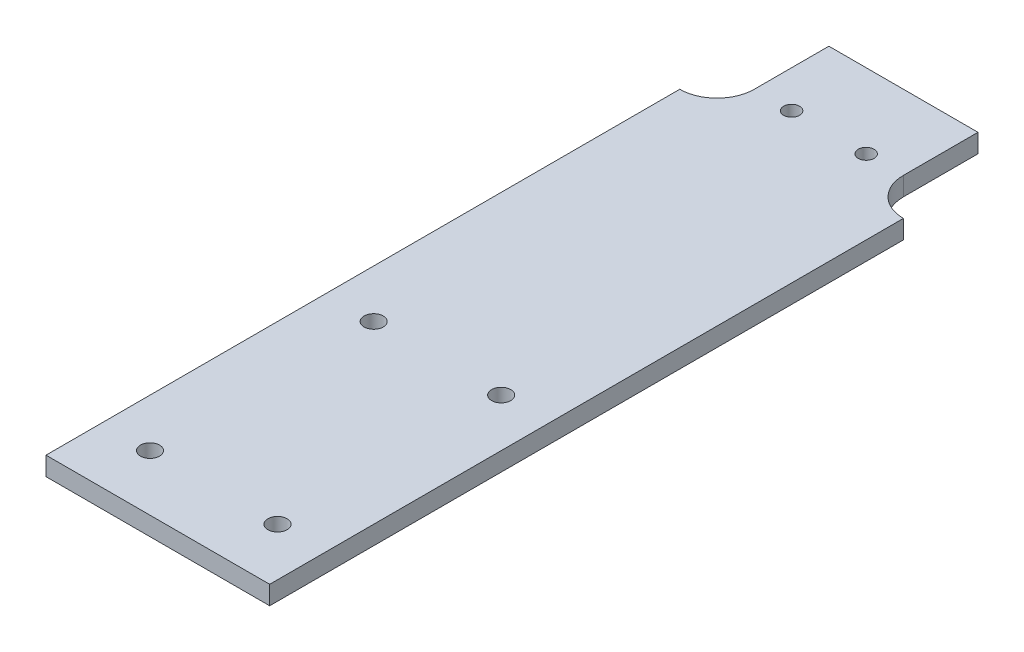
ISO-10303-21;
HEADER;
FILE_DESCRIPTION(('STEP AP214'),'2;1');
FILE_NAME('part.step','',(''),(''),'','','');
FILE_SCHEMA(('AUTOMOTIVE_DESIGN { 1 0 10303 214 1 1 1 1 }'));
ENDSEC;
DATA;
#1=APPLICATION_CONTEXT('core data for automotive mechanical design processes');
#2=APPLICATION_PROTOCOL_DEFINITION('international standard','automotive_design',2000,#1);
#3=PRODUCT_CONTEXT('',#1,'mechanical');
#4=PRODUCT('Part','Part','',(#3));
#5=PRODUCT_RELATED_PRODUCT_CATEGORY('part','',(#4));
#6=PRODUCT_DEFINITION_FORMATION('','',#4);
#7=PRODUCT_DEFINITION_CONTEXT('part definition',#1,'design');
#8=PRODUCT_DEFINITION('design','',#6,#7);
#9=PRODUCT_DEFINITION_SHAPE('','',#8);
#10=(LENGTH_UNIT() NAMED_UNIT(*) SI_UNIT(.MILLI.,.METRE.));
#11=(NAMED_UNIT(*) PLANE_ANGLE_UNIT() SI_UNIT($,.RADIAN.));
#12=(NAMED_UNIT(*) SI_UNIT($,.STERADIAN.) SOLID_ANGLE_UNIT());
#13=UNCERTAINTY_MEASURE_WITH_UNIT(LENGTH_MEASURE(1.E-05),#10,'distance_accuracy_value','');
#14=(GEOMETRIC_REPRESENTATION_CONTEXT(3) GLOBAL_UNCERTAINTY_ASSIGNED_CONTEXT((#13)) GLOBAL_UNIT_ASSIGNED_CONTEXT((#10,
#11,#12)) REPRESENTATION_CONTEXT('',''));
#15=CARTESIAN_POINT('',(0.,0.,0.));
#16=DIRECTION('',(0.,0.,1.));
#17=DIRECTION('',(1.,0.,0.));
#18=AXIS2_PLACEMENT_3D('',#15,#16,#17);
#19=CARTESIAN_POINT('',(-19.05,3.175,-50.8));
#20=DIRECTION('',(1.,0.,0.));
#21=DIRECTION('',(0.,0.,-1.));
#22=AXIS2_PLACEMENT_3D('',#19,#20,#21);
#23=PLANE('',#22);
#24=DIRECTION('',(0.,0.,1.));
#25=VECTOR('',#24,1.);
#26=CARTESIAN_POINT('',(-19.05,3.175,-50.8));
#27=LINE('',#26,#25);
#28=CARTESIAN_POINT('',(-19.05,3.175,-31.75));
#29=VERTEX_POINT('',#28);
#30=CARTESIAN_POINT('',(-19.05,3.175,76.2));
#31=VERTEX_POINT('',#30);
#32=EDGE_CURVE('E120',#29,#31,#27,.T.);
#33=ORIENTED_EDGE('',*,*,#32,.F.);
#34=DIRECTION('',(0.,-1.,0.));
#35=VECTOR('',#34,1.);
#36=CARTESIAN_POINT('',(-19.05,3.175,-31.75));
#37=LINE('',#36,#35);
#38=CARTESIAN_POINT('',(-19.05,0.,-31.75));
#39=VERTEX_POINT('',#38);
#40=EDGE_CURVE('E168',#29,#39,#37,.T.);
#41=ORIENTED_EDGE('',*,*,#40,.T.);
#42=DIRECTION('',(0.,0.,1.));
#43=VECTOR('',#42,1.);
#44=CARTESIAN_POINT('',(-19.05,0.,-50.8));
#45=LINE('',#44,#43);
#46=CARTESIAN_POINT('',(-19.05,0.,76.2));
#47=VERTEX_POINT('',#46);
#48=EDGE_CURVE('E196',#39,#47,#45,.T.);
#49=ORIENTED_EDGE('',*,*,#48,.T.);
#50=DIRECTION('',(0.,-1.,0.));
#51=VECTOR('',#50,1.);
#52=CARTESIAN_POINT('',(-19.05,3.175,76.2));
#53=LINE('',#52,#51);
#54=EDGE_CURVE('E137',#31,#47,#53,.T.);
#55=ORIENTED_EDGE('',*,*,#54,.F.);
#56=EDGE_LOOP('',(#33,#41,#49,#55));
#57=FACE_BOUND('',#56,.T.);
#58=ADVANCED_FACE('F34',(#57),#23,.F.);
#59=CARTESIAN_POINT('',(-19.05,3.175,76.2));
#60=DIRECTION('',(0.,0.,-1.));
#61=DIRECTION('',(-1.,0.,0.));
#62=AXIS2_PLACEMENT_3D('',#59,#60,#61);
#63=PLANE('',#62);
#64=DIRECTION('',(1.,0.,0.));
#65=VECTOR('',#64,1.);
#66=CARTESIAN_POINT('',(-19.05,0.,76.2));
#67=LINE('',#66,#65);
#68=CARTESIAN_POINT('',(19.05,0.,76.2));
#69=VERTEX_POINT('',#68);
#70=EDGE_CURVE('E126',#47,#69,#67,.T.);
#71=ORIENTED_EDGE('',*,*,#70,.T.);
#72=DIRECTION('',(0.,-1.,0.));
#73=VECTOR('',#72,1.);
#74=CARTESIAN_POINT('',(19.05,3.175,76.2));
#75=LINE('',#74,#73);
#76=CARTESIAN_POINT('',(19.05,3.175,76.2));
#77=VERTEX_POINT('',#76);
#78=EDGE_CURVE('E134',#77,#69,#75,.T.);
#79=ORIENTED_EDGE('',*,*,#78,.F.);
#80=DIRECTION('',(1.,0.,0.));
#81=VECTOR('',#80,1.);
#82=CARTESIAN_POINT('',(-19.05,3.175,76.2));
#83=LINE('',#82,#81);
#84=EDGE_CURVE('E123',#31,#77,#83,.T.);
#85=ORIENTED_EDGE('',*,*,#84,.F.);
#86=ORIENTED_EDGE('',*,*,#54,.T.);
#87=EDGE_LOOP('',(#71,#79,#85,#86));
#88=FACE_BOUND('',#87,.T.);
#89=ADVANCED_FACE('F198',(#88),#63,.F.);
#90=CARTESIAN_POINT('',(19.05,3.175,-50.8));
#91=DIRECTION('',(-1.,0.,0.));
#92=DIRECTION('',(0.,0.,1.));
#93=AXIS2_PLACEMENT_3D('',#90,#91,#92);
#94=PLANE('',#93);
#95=DIRECTION('',(0.,0.,-1.));
#96=VECTOR('',#95,1.);
#97=CARTESIAN_POINT('',(19.05,0.,-50.8));
#98=LINE('',#97,#96);
#99=CARTESIAN_POINT('',(19.05,0.,-31.75));
#100=VERTEX_POINT('',#99);
#101=EDGE_CURVE('E121',#69,#100,#98,.T.);
#102=ORIENTED_EDGE('',*,*,#101,.T.);
#103=DIRECTION('',(0.,-1.,0.));
#104=VECTOR('',#103,1.);
#105=CARTESIAN_POINT('',(19.05,3.175,-31.75));
#106=LINE('',#105,#104);
#107=CARTESIAN_POINT('',(19.05,3.175,-31.75));
#108=VERTEX_POINT('',#107);
#109=EDGE_CURVE('E115',#108,#100,#106,.T.);
#110=ORIENTED_EDGE('',*,*,#109,.F.);
#111=DIRECTION('',(0.,0.,-1.));
#112=VECTOR('',#111,1.);
#113=CARTESIAN_POINT('',(19.05,3.175,-50.8));
#114=LINE('',#113,#112);
#115=EDGE_CURVE('E131',#77,#108,#114,.T.);
#116=ORIENTED_EDGE('',*,*,#115,.F.);
#117=ORIENTED_EDGE('',*,*,#78,.T.);
#118=EDGE_LOOP('',(#102,#110,#116,#117));
#119=FACE_BOUND('',#118,.T.);
#120=ADVANCED_FACE('F156',(#119),#94,.F.);
#121=CARTESIAN_POINT('',(-19.05,3.175,-50.8));
#122=DIRECTION('',(0.,0.,1.));
#123=DIRECTION('',(1.,0.,0.));
#124=AXIS2_PLACEMENT_3D('',#121,#122,#123);
#125=PLANE('',#124);
#126=DIRECTION('',(-1.,0.,0.));
#127=VECTOR('',#126,1.);
#128=CARTESIAN_POINT('',(-19.05,3.175,-50.8));
#129=LINE('',#128,#127);
#130=CARTESIAN_POINT('',(12.7,3.175,-50.8));
#131=VERTEX_POINT('',#130);
#132=CARTESIAN_POINT('',(-12.7,3.175,-50.8));
#133=VERTEX_POINT('',#132);
#134=EDGE_CURVE('E113',#131,#133,#129,.T.);
#135=ORIENTED_EDGE('',*,*,#134,.F.);
#136=DIRECTION('',(0.,-1.,0.));
#137=VECTOR('',#136,1.);
#138=CARTESIAN_POINT('',(12.7,3.175,-50.8));
#139=LINE('',#138,#137);
#140=CARTESIAN_POINT('',(12.7,0.,-50.8));
#141=VERTEX_POINT('',#140);
#142=EDGE_CURVE('E100',#131,#141,#139,.T.);
#143=ORIENTED_EDGE('',*,*,#142,.T.);
#144=DIRECTION('',(-1.,0.,0.));
#145=VECTOR('',#144,1.);
#146=CARTESIAN_POINT('',(-19.05,0.,-50.8));
#147=LINE('',#146,#145);
#148=CARTESIAN_POINT('',(-12.7,0.,-50.8));
#149=VERTEX_POINT('',#148);
#150=EDGE_CURVE('E111',#141,#149,#147,.T.);
#151=ORIENTED_EDGE('',*,*,#150,.T.);
#152=DIRECTION('',(0.,-1.,0.));
#153=VECTOR('',#152,1.);
#154=CARTESIAN_POINT('',(-12.7,3.175,-50.8));
#155=LINE('',#154,#153);
#156=EDGE_CURVE('E167',#133,#149,#155,.T.);
#157=ORIENTED_EDGE('',*,*,#156,.F.);
#158=EDGE_LOOP('',(#135,#143,#151,#157));
#159=FACE_BOUND('',#158,.T.);
#160=ADVANCED_FACE('F109',(#159),#125,.F.);
#161=CARTESIAN_POINT('',(-19.05,3.175,-50.8));
#162=DIRECTION('',(0.,1.,0.));
#163=DIRECTION('',(0.,0.,1.));
#164=AXIS2_PLACEMENT_3D('',#161,#162,#163);
#165=PLANE('',#164);
#166=CARTESIAN_POINT('',(-6.35,3.175,-38.1));
#167=DIRECTION('',(0.,1.,0.));
#168=DIRECTION('',(0.,0.,1.));
#169=AXIS2_PLACEMENT_3D('',#166,#167,#168);
#170=CIRCLE('',#169,1.35254999999999);
#171=CARTESIAN_POINT('',(-6.35,3.175,-36.74745));
#172=VERTEX_POINT('',#171);
#173=EDGE_CURVE('E147',#172,#172,#170,.T.);
#174=ORIENTED_EDGE('',*,*,#173,.F.);
#175=EDGE_LOOP('',(#174));
#176=FACE_BOUND('',#175,.T.);
#177=CARTESIAN_POINT('',(6.35,3.175,-38.1));
#178=DIRECTION('',(0.,1.,0.));
#179=DIRECTION('',(0.,0.,1.));
#180=AXIS2_PLACEMENT_3D('',#177,#178,#179);
#181=CIRCLE('',#180,1.35254999999999);
#182=CARTESIAN_POINT('',(6.35,3.175,-36.74745));
#183=VERTEX_POINT('',#182);
#184=EDGE_CURVE('E143',#183,#183,#181,.T.);
#185=ORIENTED_EDGE('',*,*,#184,.F.);
#186=EDGE_LOOP('',(#185));
#187=FACE_BOUND('',#186,.T.);
#188=ORIENTED_EDGE('',*,*,#115,.T.);
#189=CARTESIAN_POINT('',(19.05,3.175,-38.1));
#190=DIRECTION('',(0.,1.,0.));
#191=DIRECTION('',(0.,0.,1.));
#192=AXIS2_PLACEMENT_3D('',#189,#190,#191);
#193=CIRCLE('',#192,6.35);
#194=CARTESIAN_POINT('',(12.7,3.175,-38.1));
#195=VERTEX_POINT('',#194);
#196=EDGE_CURVE('E11',#108,#195,#193,.F.);
#197=ORIENTED_EDGE('',*,*,#196,.T.);
#198=DIRECTION('',(0.,0.,-1.));
#199=VECTOR('',#198,1.);
#200=CARTESIAN_POINT('',(12.7,3.175,-50.8));
#201=LINE('',#200,#199);
#202=EDGE_CURVE('E105',#195,#131,#201,.T.);
#203=ORIENTED_EDGE('',*,*,#202,.T.);
#204=ORIENTED_EDGE('',*,*,#134,.T.);
#205=DIRECTION('',(0.,0.,1.));
#206=VECTOR('',#205,1.);
#207=CARTESIAN_POINT('',(-12.7,3.175,-50.8));
#208=LINE('',#207,#206);
#209=CARTESIAN_POINT('',(-12.7,3.175,-38.1));
#210=VERTEX_POINT('',#209);
#211=EDGE_CURVE('E164',#133,#210,#208,.T.);
#212=ORIENTED_EDGE('',*,*,#211,.T.);
#213=CARTESIAN_POINT('',(-19.05,3.175,-38.1));
#214=DIRECTION('',(0.,1.,0.));
#215=DIRECTION('',(0.,0.,1.));
#216=AXIS2_PLACEMENT_3D('',#213,#214,#215);
#217=CIRCLE('',#216,6.35);
#218=EDGE_CURVE('E152',#210,#29,#217,.F.);
#219=ORIENTED_EDGE('',*,*,#218,.T.);
#220=ORIENTED_EDGE('',*,*,#32,.T.);
#221=ORIENTED_EDGE('',*,*,#84,.T.);
#222=EDGE_LOOP('',(#188,#197,#203,#204,#212,#219,#220,#221));
#223=FACE_BOUND('',#222,.T.);
#224=CARTESIAN_POINT('',(-10.8585,3.175,28.575));
#225=DIRECTION('',(0.,1.,0.));
#226=DIRECTION('',(0.,0.,1.));
#227=AXIS2_PLACEMENT_3D('',#224,#225,#226);
#228=CIRCLE('',#227,1.63194999999998);
#229=CARTESIAN_POINT('',(-10.8585,3.175,30.20695));
#230=VERTEX_POINT('',#229);
#231=EDGE_CURVE('E175',#230,#230,#228,.T.);
#232=ORIENTED_EDGE('',*,*,#231,.F.);
#233=EDGE_LOOP('',(#232));
#234=FACE_BOUND('',#233,.T.);
#235=CARTESIAN_POINT('',(10.8585,3.175,28.575));
#236=DIRECTION('',(0.,1.,0.));
#237=DIRECTION('',(0.,0.,1.));
#238=AXIS2_PLACEMENT_3D('',#235,#236,#237);
#239=CIRCLE('',#238,1.63194999999998);
#240=CARTESIAN_POINT('',(10.8585,3.175,30.20695));
#241=VERTEX_POINT('',#240);
#242=EDGE_CURVE('E181',#241,#241,#239,.T.);
#243=ORIENTED_EDGE('',*,*,#242,.F.);
#244=EDGE_LOOP('',(#243));
#245=FACE_BOUND('',#244,.T.);
#246=CARTESIAN_POINT('',(-10.8585,3.175,66.675));
#247=DIRECTION('',(0.,1.,0.));
#248=DIRECTION('',(0.,0.,1.));
#249=AXIS2_PLACEMENT_3D('',#246,#247,#248);
#250=CIRCLE('',#249,1.63194999999998);
#251=CARTESIAN_POINT('',(-10.8585,3.175,68.30695));
#252=VERTEX_POINT('',#251);
#253=EDGE_CURVE('E187',#252,#252,#250,.T.);
#254=ORIENTED_EDGE('',*,*,#253,.F.);
#255=EDGE_LOOP('',(#254));
#256=FACE_BOUND('',#255,.T.);
#257=CARTESIAN_POINT('',(10.8585,3.175,66.675));
#258=DIRECTION('',(0.,1.,0.));
#259=DIRECTION('',(0.,0.,1.));
#260=AXIS2_PLACEMENT_3D('',#257,#258,#259);
#261=CIRCLE('',#260,1.63194999999998);
#262=CARTESIAN_POINT('',(10.8585,3.175,68.30695));
#263=VERTEX_POINT('',#262);
#264=EDGE_CURVE('E193',#263,#263,#261,.T.);
#265=ORIENTED_EDGE('',*,*,#264,.F.);
#266=EDGE_LOOP('',(#265));
#267=FACE_BOUND('',#266,.T.);
#268=ADVANCED_FACE('F212',(#176,#187,#223,#234,#245,#256,#267),#165,.T.);
#269=CARTESIAN_POINT('',(-19.05,0.,-50.8));
#270=DIRECTION('',(0.,1.,0.));
#271=DIRECTION('',(0.,0.,1.));
#272=AXIS2_PLACEMENT_3D('',#269,#270,#271);
#273=PLANE('',#272);
#274=CARTESIAN_POINT('',(-6.35,0.,-38.1));
#275=DIRECTION('',(0.,1.,0.));
#276=DIRECTION('',(0.,0.,1.));
#277=AXIS2_PLACEMENT_3D('',#274,#275,#276);
#278=CIRCLE('',#277,1.35254999999999);
#279=CARTESIAN_POINT('',(-6.35,0.,-36.74745));
#280=VERTEX_POINT('',#279);
#281=EDGE_CURVE('E144',#280,#280,#278,.T.);
#282=ORIENTED_EDGE('',*,*,#281,.T.);
#283=EDGE_LOOP('',(#282));
#284=FACE_BOUND('',#283,.T.);
#285=CARTESIAN_POINT('',(6.35,0.,-38.1));
#286=DIRECTION('',(0.,1.,0.));
#287=DIRECTION('',(0.,0.,1.));
#288=AXIS2_PLACEMENT_3D('',#285,#286,#287);
#289=CIRCLE('',#288,1.35254999999999);
#290=CARTESIAN_POINT('',(6.35,0.,-36.74745));
#291=VERTEX_POINT('',#290);
#292=EDGE_CURVE('E106',#291,#291,#289,.T.);
#293=ORIENTED_EDGE('',*,*,#292,.T.);
#294=EDGE_LOOP('',(#293));
#295=FACE_BOUND('',#294,.T.);
#296=CARTESIAN_POINT('',(-10.8585,0.,28.575));
#297=DIRECTION('',(0.,-1.,0.));
#298=DIRECTION('',(0.,0.,-1.));
#299=AXIS2_PLACEMENT_3D('',#296,#297,#298);
#300=CIRCLE('',#299,1.63194999999999);
#301=CARTESIAN_POINT('',(-10.8585,0.,26.94305));
#302=VERTEX_POINT('',#301);
#303=EDGE_CURVE('E171',#302,#302,#300,.T.);
#304=ORIENTED_EDGE('',*,*,#303,.F.);
#305=EDGE_LOOP('',(#304));
#306=FACE_BOUND('',#305,.T.);
#307=CARTESIAN_POINT('',(10.8585,0.,28.575));
#308=DIRECTION('',(0.,-1.,0.));
#309=DIRECTION('',(0.,0.,-1.));
#310=AXIS2_PLACEMENT_3D('',#307,#308,#309);
#311=CIRCLE('',#310,1.63194999999999);
#312=CARTESIAN_POINT('',(10.8585,0.,26.94305));
#313=VERTEX_POINT('',#312);
#314=EDGE_CURVE('E178',#313,#313,#311,.T.);
#315=ORIENTED_EDGE('',*,*,#314,.F.);
#316=EDGE_LOOP('',(#315));
#317=FACE_BOUND('',#316,.T.);
#318=CARTESIAN_POINT('',(-10.8585,0.,66.675));
#319=DIRECTION('',(0.,-1.,0.));
#320=DIRECTION('',(0.,0.,-1.));
#321=AXIS2_PLACEMENT_3D('',#318,#319,#320);
#322=CIRCLE('',#321,1.63194999999999);
#323=CARTESIAN_POINT('',(-10.8585,0.,65.04305));
#324=VERTEX_POINT('',#323);
#325=EDGE_CURVE('E184',#324,#324,#322,.T.);
#326=ORIENTED_EDGE('',*,*,#325,.F.);
#327=EDGE_LOOP('',(#326));
#328=FACE_BOUND('',#327,.T.);
#329=CARTESIAN_POINT('',(10.8585,0.,66.675));
#330=DIRECTION('',(0.,-1.,0.));
#331=DIRECTION('',(0.,0.,-1.));
#332=AXIS2_PLACEMENT_3D('',#329,#330,#331);
#333=CIRCLE('',#332,1.63194999999999);
#334=CARTESIAN_POINT('',(10.8585,0.,65.04305));
#335=VERTEX_POINT('',#334);
#336=EDGE_CURVE('E190',#335,#335,#333,.T.);
#337=ORIENTED_EDGE('',*,*,#336,.F.);
#338=EDGE_LOOP('',(#337));
#339=FACE_BOUND('',#338,.T.);
#340=ORIENTED_EDGE('',*,*,#150,.F.);
#341=DIRECTION('',(0.,0.,-1.));
#342=VECTOR('',#341,1.);
#343=CARTESIAN_POINT('',(12.7,0.,-50.8));
#344=LINE('',#343,#342);
#345=CARTESIAN_POINT('',(12.7,0.,-38.1));
#346=VERTEX_POINT('',#345);
#347=EDGE_CURVE('E97',#346,#141,#344,.T.);
#348=ORIENTED_EDGE('',*,*,#347,.F.);
#349=CARTESIAN_POINT('',(19.05,0.,-38.1));
#350=DIRECTION('',(0.,1.,0.));
#351=DIRECTION('',(0.,0.,1.));
#352=AXIS2_PLACEMENT_3D('',#349,#350,#351);
#353=CIRCLE('',#352,6.35);
#354=EDGE_CURVE('E41',#346,#100,#353,.T.);
#355=ORIENTED_EDGE('',*,*,#354,.T.);
#356=ORIENTED_EDGE('',*,*,#101,.F.);
#357=ORIENTED_EDGE('',*,*,#70,.F.);
#358=ORIENTED_EDGE('',*,*,#48,.F.);
#359=CARTESIAN_POINT('',(-19.05,0.,-38.1));
#360=DIRECTION('',(0.,1.,0.));
#361=DIRECTION('',(0.,0.,1.));
#362=AXIS2_PLACEMENT_3D('',#359,#360,#361);
#363=CIRCLE('',#362,6.35);
#364=CARTESIAN_POINT('',(-12.7,0.,-38.1));
#365=VERTEX_POINT('',#364);
#366=EDGE_CURVE('E150',#39,#365,#363,.T.);
#367=ORIENTED_EDGE('',*,*,#366,.T.);
#368=DIRECTION('',(0.,0.,1.));
#369=VECTOR('',#368,1.);
#370=CARTESIAN_POINT('',(-12.7,0.,-50.8));
#371=LINE('',#370,#369);
#372=EDGE_CURVE('E114',#149,#365,#371,.T.);
#373=ORIENTED_EDGE('',*,*,#372,.F.);
#374=EDGE_LOOP('',(#340,#348,#355,#356,#357,#358,#367,#373));
#375=FACE_BOUND('',#374,.T.);
#376=ADVANCED_FACE('F118',(#284,#295,#306,#317,#328,#339,#375),#273,.F.);
#377=CARTESIAN_POINT('',(10.8585,0.,66.675));
#378=DIRECTION('',(0.,-1.,0.));
#379=DIRECTION('',(0.,0.,-1.));
#380=AXIS2_PLACEMENT_3D('',#377,#378,#379);
#381=CYLINDRICAL_SURFACE('',#380,1.63194999999998);
#382=ORIENTED_EDGE('',*,*,#264,.T.);
#383=EDGE_LOOP('',(#382));
#384=FACE_BOUND('',#383,.T.);
#385=ORIENTED_EDGE('',*,*,#336,.T.);
#386=EDGE_LOOP('',(#385));
#387=FACE_BOUND('',#386,.T.);
#388=ADVANCED_FACE('F225',(#384,#387),#381,.F.);
#389=CARTESIAN_POINT('',(-10.8585,0.,66.675));
#390=DIRECTION('',(0.,-1.,0.));
#391=DIRECTION('',(0.,0.,-1.));
#392=AXIS2_PLACEMENT_3D('',#389,#390,#391);
#393=CYLINDRICAL_SURFACE('',#392,1.63194999999998);
#394=ORIENTED_EDGE('',*,*,#253,.T.);
#395=EDGE_LOOP('',(#394));
#396=FACE_BOUND('',#395,.T.);
#397=ORIENTED_EDGE('',*,*,#325,.T.);
#398=EDGE_LOOP('',(#397));
#399=FACE_BOUND('',#398,.T.);
#400=ADVANCED_FACE('F228',(#396,#399),#393,.F.);
#401=CARTESIAN_POINT('',(10.8585,0.,28.575));
#402=DIRECTION('',(0.,-1.,0.));
#403=DIRECTION('',(0.,0.,-1.));
#404=AXIS2_PLACEMENT_3D('',#401,#402,#403);
#405=CYLINDRICAL_SURFACE('',#404,1.63194999999998);
#406=ORIENTED_EDGE('',*,*,#242,.T.);
#407=EDGE_LOOP('',(#406));
#408=FACE_BOUND('',#407,.T.);
#409=ORIENTED_EDGE('',*,*,#314,.T.);
#410=EDGE_LOOP('',(#409));
#411=FACE_BOUND('',#410,.T.);
#412=ADVANCED_FACE('F316',(#408,#411),#405,.F.);
#413=CARTESIAN_POINT('',(-10.8585,0.,28.575));
#414=DIRECTION('',(0.,-1.,0.));
#415=DIRECTION('',(0.,0.,-1.));
#416=AXIS2_PLACEMENT_3D('',#413,#414,#415);
#417=CYLINDRICAL_SURFACE('',#416,1.63194999999998);
#418=ORIENTED_EDGE('',*,*,#231,.T.);
#419=EDGE_LOOP('',(#418));
#420=FACE_BOUND('',#419,.T.);
#421=ORIENTED_EDGE('',*,*,#303,.T.);
#422=EDGE_LOOP('',(#421));
#423=FACE_BOUND('',#422,.T.);
#424=ADVANCED_FACE('F274',(#420,#423),#417,.F.);
#425=CARTESIAN_POINT('',(-12.7,3.175,-50.8));
#426=DIRECTION('',(1.,0.,0.));
#427=DIRECTION('',(0.,0.,-1.));
#428=AXIS2_PLACEMENT_3D('',#425,#426,#427);
#429=PLANE('',#428);
#430=ORIENTED_EDGE('',*,*,#372,.T.);
#431=DIRECTION('',(0.,-1.,0.));
#432=VECTOR('',#431,1.);
#433=CARTESIAN_POINT('',(-12.7,3.175,-38.1));
#434=LINE('',#433,#432);
#435=EDGE_CURVE('E140',#365,#210,#434,.F.);
#436=ORIENTED_EDGE('',*,*,#435,.T.);
#437=ORIENTED_EDGE('',*,*,#211,.F.);
#438=ORIENTED_EDGE('',*,*,#156,.T.);
#439=EDGE_LOOP('',(#430,#436,#437,#438));
#440=FACE_BOUND('',#439,.T.);
#441=ADVANCED_FACE('F211',(#440),#429,.F.);
#442=CARTESIAN_POINT('',(12.7,3.175,-50.8));
#443=DIRECTION('',(-1.,0.,0.));
#444=DIRECTION('',(0.,0.,1.));
#445=AXIS2_PLACEMENT_3D('',#442,#443,#444);
#446=PLANE('',#445);
#447=ORIENTED_EDGE('',*,*,#202,.F.);
#448=DIRECTION('',(0.,-1.,0.));
#449=VECTOR('',#448,1.);
#450=CARTESIAN_POINT('',(12.7,0.,-38.1));
#451=LINE('',#450,#449);
#452=EDGE_CURVE('E102',#195,#346,#451,.T.);
#453=ORIENTED_EDGE('',*,*,#452,.T.);
#454=ORIENTED_EDGE('',*,*,#347,.T.);
#455=ORIENTED_EDGE('',*,*,#142,.F.);
#456=EDGE_LOOP('',(#447,#453,#454,#455));
#457=FACE_BOUND('',#456,.T.);
#458=ADVANCED_FACE('F99',(#457),#446,.F.);
#459=CARTESIAN_POINT('',(6.35,3.175,-38.1));
#460=DIRECTION('',(0.,1.,0.));
#461=DIRECTION('',(0.,0.,1.));
#462=AXIS2_PLACEMENT_3D('',#459,#460,#461);
#463=CYLINDRICAL_SURFACE('',#462,1.35254999999999);
#464=ORIENTED_EDGE('',*,*,#184,.T.);
#465=EDGE_LOOP('',(#464));
#466=FACE_BOUND('',#465,.T.);
#467=ORIENTED_EDGE('',*,*,#292,.F.);
#468=EDGE_LOOP('',(#467));
#469=FACE_BOUND('',#468,.T.);
#470=ADVANCED_FACE('F285',(#466,#469),#463,.F.);
#471=CARTESIAN_POINT('',(-6.35,3.175,-38.1));
#472=DIRECTION('',(0.,1.,0.));
#473=DIRECTION('',(0.,0.,1.));
#474=AXIS2_PLACEMENT_3D('',#471,#472,#473);
#475=CYLINDRICAL_SURFACE('',#474,1.35254999999999);
#476=ORIENTED_EDGE('',*,*,#173,.T.);
#477=EDGE_LOOP('',(#476));
#478=FACE_BOUND('',#477,.T.);
#479=ORIENTED_EDGE('',*,*,#281,.F.);
#480=EDGE_LOOP('',(#479));
#481=FACE_BOUND('',#480,.T.);
#482=ADVANCED_FACE('F296',(#478,#481),#475,.F.);
#483=CARTESIAN_POINT('',(-19.05,3.175,-38.1));
#484=DIRECTION('',(0.,1.,0.));
#485=DIRECTION('',(0.,0.,1.));
#486=AXIS2_PLACEMENT_3D('',#483,#484,#485);
#487=CYLINDRICAL_SURFACE('',#486,6.35);
#488=ORIENTED_EDGE('',*,*,#218,.F.);
#489=ORIENTED_EDGE('',*,*,#435,.F.);
#490=ORIENTED_EDGE('',*,*,#366,.F.);
#491=ORIENTED_EDGE('',*,*,#40,.F.);
#492=EDGE_LOOP('',(#488,#489,#490,#491));
#493=FACE_BOUND('',#492,.T.);
#494=ADVANCED_FACE('F207',(#493),#487,.F.);
#495=CARTESIAN_POINT('',(19.05,3.175,-38.1));
#496=DIRECTION('',(0.,1.,0.));
#497=DIRECTION('',(0.,0.,1.));
#498=AXIS2_PLACEMENT_3D('',#495,#496,#497);
#499=CYLINDRICAL_SURFACE('',#498,6.35);
#500=ORIENTED_EDGE('',*,*,#196,.F.);
#501=ORIENTED_EDGE('',*,*,#109,.T.);
#502=ORIENTED_EDGE('',*,*,#354,.F.);
#503=ORIENTED_EDGE('',*,*,#452,.F.);
#504=EDGE_LOOP('',(#500,#501,#502,#503));
#505=FACE_BOUND('',#504,.T.);
#506=ADVANCED_FACE('F159',(#505),#499,.F.);
#507=CLOSED_SHELL('',(#58,#89,#120,#160,#268,#376,#388,#400,#412,#424,#441,#458,#470,#482,#494,#506));
#508=MANIFOLD_SOLID_BREP('B2',#507);
#509=ADVANCED_BREP_SHAPE_REPRESENTATION('',(#18,#508),#14);
#510=SHAPE_DEFINITION_REPRESENTATION(#9,#509);
ENDSEC;
END-ISO-10303-21;
